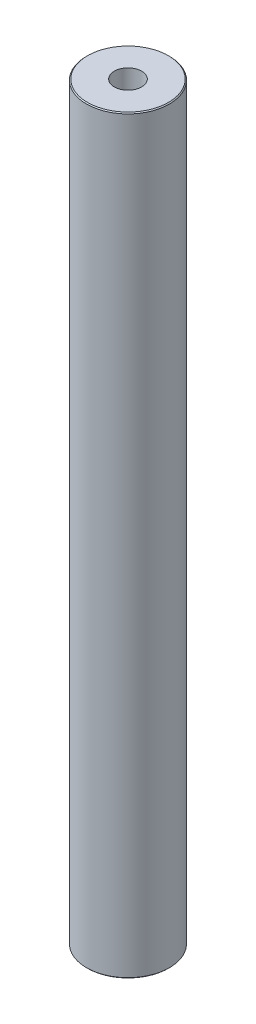
ISO-10303-21;
HEADER;
FILE_DESCRIPTION(('STEP AP214'),'2;1');
FILE_NAME('part.step','',(''),(''),'','','');
FILE_SCHEMA(('AUTOMOTIVE_DESIGN { 1 0 10303 214 1 1 1 1 }'));
ENDSEC;
DATA;
#1=APPLICATION_CONTEXT('core data for automotive mechanical design processes');
#2=APPLICATION_PROTOCOL_DEFINITION('international standard','automotive_design',2000,#1);
#3=PRODUCT_CONTEXT('',#1,'mechanical');
#4=PRODUCT('Part','Part','',(#3));
#5=PRODUCT_RELATED_PRODUCT_CATEGORY('part','',(#4));
#6=PRODUCT_DEFINITION_FORMATION('','',#4);
#7=PRODUCT_DEFINITION_CONTEXT('part definition',#1,'design');
#8=PRODUCT_DEFINITION('design','',#6,#7);
#9=PRODUCT_DEFINITION_SHAPE('','',#8);
#10=(LENGTH_UNIT() NAMED_UNIT(*) SI_UNIT(.MILLI.,.METRE.));
#11=(NAMED_UNIT(*) PLANE_ANGLE_UNIT() SI_UNIT($,.RADIAN.));
#12=(NAMED_UNIT(*) SI_UNIT($,.STERADIAN.) SOLID_ANGLE_UNIT());
#13=UNCERTAINTY_MEASURE_WITH_UNIT(LENGTH_MEASURE(1.E-05),#10,'distance_accuracy_value','');
#14=(GEOMETRIC_REPRESENTATION_CONTEXT(3) GLOBAL_UNCERTAINTY_ASSIGNED_CONTEXT((#13)) GLOBAL_UNIT_ASSIGNED_CONTEXT((#10,
#11,#12)) REPRESENTATION_CONTEXT('',''));
#15=CARTESIAN_POINT('',(0.,0.,0.));
#16=DIRECTION('',(0.,0.,1.));
#17=DIRECTION('',(1.,0.,0.));
#18=AXIS2_PLACEMENT_3D('',#15,#16,#17);
#19=CARTESIAN_POINT('',(0.,226.231428448043,0.));
#20=DIRECTION('',(0.,-1.,0.));
#21=DIRECTION('',(0.,0.,-1.));
#22=AXIS2_PLACEMENT_3D('',#19,#20,#21);
#23=CYLINDRICAL_SURFACE('',#22,12.5);
#24=CARTESIAN_POINT('',(0.,225.941494947666,0.));
#25=DIRECTION('',(0.,1.,0.));
#26=DIRECTION('',(0.,0.,1.));
#27=AXIS2_PLACEMENT_3D('',#24,#25,#26);
#28=CIRCLE('',#27,12.5);
#29=CARTESIAN_POINT('',(0.,225.941494947666,12.5));
#30=VERTEX_POINT('',#29);
#31=EDGE_CURVE('E50',#30,#30,#28,.F.);
#32=ORIENTED_EDGE('',*,*,#31,.T.);
#33=EDGE_LOOP('',(#32));
#34=FACE_BOUND('',#33,.T.);
#35=CARTESIAN_POINT('',(0.,0.291605895342356,0.));
#36=DIRECTION('',(0.,1.,0.));
#37=DIRECTION('',(0.,0.,1.));
#38=AXIS2_PLACEMENT_3D('',#35,#36,#37);
#39=CIRCLE('',#38,12.5);
#40=CARTESIAN_POINT('',(0.,0.291605895342356,12.5));
#41=VERTEX_POINT('',#40);
#42=EDGE_CURVE('E51',#41,#41,#39,.T.);
#43=ORIENTED_EDGE('',*,*,#42,.T.);
#44=EDGE_LOOP('',(#43));
#45=FACE_BOUND('',#44,.T.);
#46=ADVANCED_FACE('F39',(#34,#45),#23,.T.);
#47=CARTESIAN_POINT('',(0.,226.231428448043,0.));
#48=DIRECTION('',(0.,1.,0.));
#49=DIRECTION('',(0.,0.,1.));
#50=AXIS2_PLACEMENT_3D('',#47,#48,#49);
#51=PLANE('',#50);
#52=CARTESIAN_POINT('',(0.,226.231428448043,0.));
#53=DIRECTION('',(0.,1.,0.));
#54=DIRECTION('',(0.,0.,1.));
#55=AXIS2_PLACEMENT_3D('',#52,#53,#54);
#56=CIRCLE('',#55,12.2083941046576);
#57=CARTESIAN_POINT('',(0.,226.231428448043,12.2083941046576));
#58=VERTEX_POINT('',#57);
#59=EDGE_CURVE('E54',#58,#58,#56,.T.);
#60=ORIENTED_EDGE('',*,*,#59,.T.);
#61=EDGE_LOOP('',(#60));
#62=FACE_BOUND('',#61,.T.);
#63=CARTESIAN_POINT('',(0.,226.231428448043,0.));
#64=DIRECTION('',(0.,1.,0.));
#65=DIRECTION('',(0.,0.,1.));
#66=AXIS2_PLACEMENT_3D('',#63,#64,#65);
#67=CIRCLE('',#66,4.1320902167112);
#68=CARTESIAN_POINT('',(0.,226.231428448043,4.1320902167112));
#69=VERTEX_POINT('',#68);
#70=EDGE_CURVE('E58',#69,#69,#67,.T.);
#71=ORIENTED_EDGE('',*,*,#70,.F.);
#72=EDGE_LOOP('',(#71));
#73=FACE_BOUND('',#72,.T.);
#74=ADVANCED_FACE('F69',(#62,#73),#51,.T.);
#75=CARTESIAN_POINT('',(0.,0.,0.));
#76=DIRECTION('',(0.,1.,0.));
#77=DIRECTION('',(0.,0.,1.));
#78=AXIS2_PLACEMENT_3D('',#75,#76,#77);
#79=PLANE('',#78);
#80=CARTESIAN_POINT('',(0.,0.,0.));
#81=DIRECTION('',(0.,1.,0.));
#82=DIRECTION('',(0.,0.,1.));
#83=AXIS2_PLACEMENT_3D('',#80,#81,#82);
#84=CIRCLE('',#83,12.2100664996231);
#85=CARTESIAN_POINT('',(0.,0.,12.2100664996231));
#86=VERTEX_POINT('',#85);
#87=EDGE_CURVE('E10',#86,#86,#84,.F.);
#88=ORIENTED_EDGE('',*,*,#87,.T.);
#89=EDGE_LOOP('',(#88));
#90=FACE_BOUND('',#89,.T.);
#91=CARTESIAN_POINT('',(0.,0.,0.));
#92=DIRECTION('',(0.,1.,0.));
#93=DIRECTION('',(0.,0.,1.));
#94=AXIS2_PLACEMENT_3D('',#91,#92,#93);
#95=CIRCLE('',#94,4.1320902167112);
#96=CARTESIAN_POINT('',(0.,0.,4.1320902167112));
#97=VERTEX_POINT('',#96);
#98=EDGE_CURVE('E63',#97,#97,#95,.T.);
#99=ORIENTED_EDGE('',*,*,#98,.T.);
#100=EDGE_LOOP('',(#99));
#101=FACE_BOUND('',#100,.T.);
#102=ADVANCED_FACE('F75',(#90,#101),#79,.F.);
#103=CARTESIAN_POINT('',(0.,226.231428448043,0.));
#104=DIRECTION('',(0.,-1.,0.));
#105=DIRECTION('',(0.,0.,-1.));
#106=AXIS2_PLACEMENT_3D('',#103,#104,#105);
#107=CYLINDRICAL_SURFACE('',#106,4.1320902167112);
#108=ORIENTED_EDGE('',*,*,#70,.T.);
#109=EDGE_LOOP('',(#108));
#110=FACE_BOUND('',#109,.T.);
#111=ORIENTED_EDGE('',*,*,#98,.F.);
#112=EDGE_LOOP('',(#111));
#113=FACE_BOUND('',#112,.T.);
#114=ADVANCED_FACE('F70',(#110,#113),#107,.F.);
#115=CARTESIAN_POINT('',(0.,226.231428448043,0.));
#116=DIRECTION('',(0.,-1.,0.));
#117=DIRECTION('',(0.,0.,-1.));
#118=AXIS2_PLACEMENT_3D('',#115,#116,#117);
#119=CONICAL_SURFACE('',#118,12.2083941046576,0.788273962298333);
#120=ORIENTED_EDGE('',*,*,#31,.F.);
#121=EDGE_LOOP('',(#120));
#122=FACE_BOUND('',#121,.T.);
#123=ORIENTED_EDGE('',*,*,#59,.F.);
#124=EDGE_LOOP('',(#123));
#125=FACE_BOUND('',#124,.T.);
#126=ADVANCED_FACE('F81',(#122,#125),#119,.T.);
#127=CARTESIAN_POINT('',(0.,0.291605895342356,0.));
#128=DIRECTION('',(0.,1.,0.));
#129=DIRECTION('',(0.,0.,1.));
#130=AXIS2_PLACEMENT_3D('',#127,#128,#129);
#131=CONICAL_SURFACE('',#130,12.5,0.782522364496524);
#132=ORIENTED_EDGE('',*,*,#87,.F.);
#133=EDGE_LOOP('',(#132));
#134=FACE_BOUND('',#133,.T.);
#135=ORIENTED_EDGE('',*,*,#42,.F.);
#136=EDGE_LOOP('',(#135));
#137=FACE_BOUND('',#136,.T.);
#138=ADVANCED_FACE('F45',(#134,#137),#131,.T.);
#139=CLOSED_SHELL('',(#46,#74,#102,#114,#126,#138));
#140=MANIFOLD_SOLID_BREP('B2',#139);
#141=ADVANCED_BREP_SHAPE_REPRESENTATION('',(#18,#140),#14);
#142=SHAPE_DEFINITION_REPRESENTATION(#9,#141);
ENDSEC;
END-ISO-10303-21;
